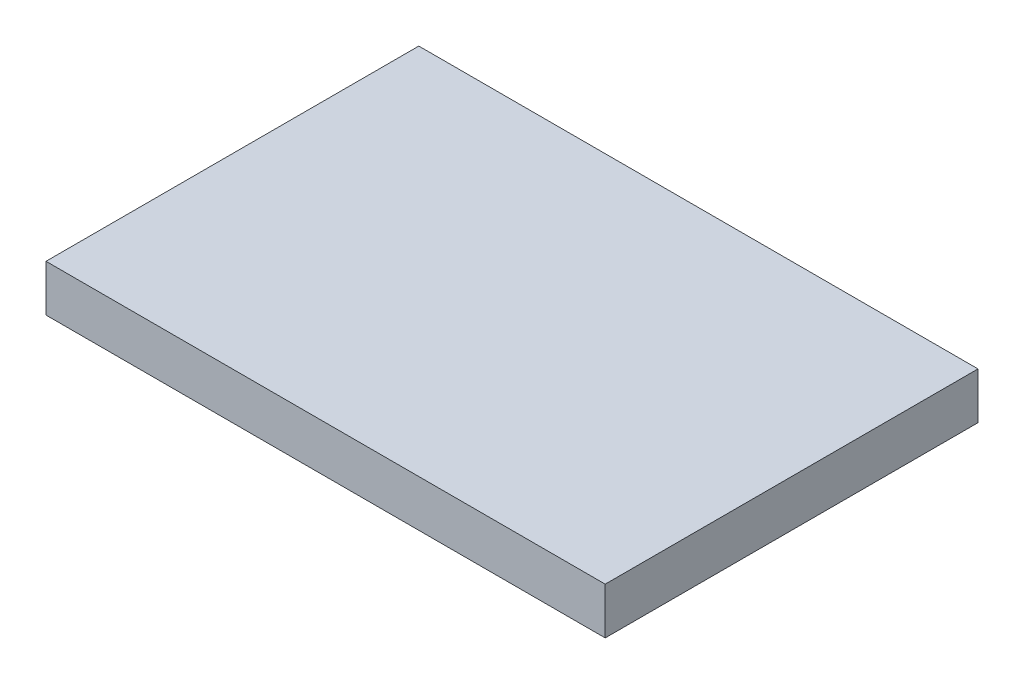
ISO-10303-21;
HEADER;
FILE_DESCRIPTION(('STEP AP214'),'2;1');
FILE_NAME('part.step','',(''),(''),'','','');
FILE_SCHEMA(('AUTOMOTIVE_DESIGN { 1 0 10303 214 1 1 1 1 }'));
ENDSEC;
DATA;
#1=APPLICATION_CONTEXT('core data for automotive mechanical design processes');
#2=APPLICATION_PROTOCOL_DEFINITION('international standard','automotive_design',2000,#1);
#3=PRODUCT_CONTEXT('',#1,'mechanical');
#4=PRODUCT('Part','Part','',(#3));
#5=PRODUCT_RELATED_PRODUCT_CATEGORY('part','',(#4));
#6=PRODUCT_DEFINITION_FORMATION('','',#4);
#7=PRODUCT_DEFINITION_CONTEXT('part definition',#1,'design');
#8=PRODUCT_DEFINITION('design','',#6,#7);
#9=PRODUCT_DEFINITION_SHAPE('','',#8);
#10=(LENGTH_UNIT() NAMED_UNIT(*) SI_UNIT(.MILLI.,.METRE.));
#11=(NAMED_UNIT(*) PLANE_ANGLE_UNIT() SI_UNIT($,.RADIAN.));
#12=(NAMED_UNIT(*) SI_UNIT($,.STERADIAN.) SOLID_ANGLE_UNIT());
#13=UNCERTAINTY_MEASURE_WITH_UNIT(LENGTH_MEASURE(1.E-05),#10,'distance_accuracy_value','');
#14=(GEOMETRIC_REPRESENTATION_CONTEXT(3) GLOBAL_UNCERTAINTY_ASSIGNED_CONTEXT((#13)) GLOBAL_UNIT_ASSIGNED_CONTEXT((#10,
#11,#12)) REPRESENTATION_CONTEXT('',''));
#15=CARTESIAN_POINT('',(0.,0.,0.));
#16=DIRECTION('',(0.,0.,1.));
#17=DIRECTION('',(1.,0.,0.));
#18=AXIS2_PLACEMENT_3D('',#15,#16,#17);
#19=CARTESIAN_POINT('',(-86.4894600922342,330.000000000016,26.9212642700331));
#20=DIRECTION('',(1.,0.,0.));
#21=DIRECTION('',(0.,0.,-1.));
#22=AXIS2_PLACEMENT_3D('',#19,#20,#21);
#23=PLANE('',#22);
#24=DIRECTION('',(0.,0.,-1.));
#25=VECTOR('',#24,1.);
#26=CARTESIAN_POINT('',(-86.4894600922342,340.000000000016,26.9212642700331));
#27=LINE('',#26,#25);
#28=CARTESIAN_POINT('',(-86.4894600922342,340.000000000016,26.9212642700331));
#29=VERTEX_POINT('',#28);
#30=CARTESIAN_POINT('',(-86.4894600922342,340.000000000016,-53.0787357299669));
#31=VERTEX_POINT('',#30);
#32=EDGE_CURVE('E96',#29,#31,#27,.T.);
#33=ORIENTED_EDGE('',*,*,#32,.T.);
#34=DIRECTION('',(0.,1.,0.));
#35=VECTOR('',#34,1.);
#36=CARTESIAN_POINT('',(-86.4894600922342,330.000000000016,-53.0787357299669));
#37=LINE('',#36,#35);
#38=CARTESIAN_POINT('',(-86.4894600922342,330.000000000016,-53.0787357299669));
#39=VERTEX_POINT('',#38);
#40=EDGE_CURVE('E11',#39,#31,#37,.T.);
#41=ORIENTED_EDGE('',*,*,#40,.F.);
#42=DIRECTION('',(0.,0.,-1.));
#43=VECTOR('',#42,1.);
#44=CARTESIAN_POINT('',(-86.4894600922342,330.000000000016,26.9212642700331));
#45=LINE('',#44,#43);
#46=CARTESIAN_POINT('',(-86.4894600922342,330.000000000016,26.9212642700331));
#47=VERTEX_POINT('',#46);
#48=EDGE_CURVE('E84',#47,#39,#45,.T.);
#49=ORIENTED_EDGE('',*,*,#48,.F.);
#50=DIRECTION('',(0.,1.,0.));
#51=VECTOR('',#50,1.);
#52=CARTESIAN_POINT('',(-86.4894600922342,330.000000000016,26.9212642700331));
#53=LINE('',#52,#51);
#54=EDGE_CURVE('E92',#47,#29,#53,.T.);
#55=ORIENTED_EDGE('',*,*,#54,.T.);
#56=EDGE_LOOP('',(#33,#41,#49,#55));
#57=FACE_BOUND('',#56,.T.);
#58=ADVANCED_FACE('F33',(#57),#23,.F.);
#59=CARTESIAN_POINT('',(-86.4894600922342,330.000000000016,-53.0787357299669));
#60=DIRECTION('',(0.,0.,1.));
#61=DIRECTION('',(1.,0.,0.));
#62=AXIS2_PLACEMENT_3D('',#59,#60,#61);
#63=PLANE('',#62);
#64=DIRECTION('',(1.,0.,0.));
#65=VECTOR('',#64,1.);
#66=CARTESIAN_POINT('',(-86.4894600922342,340.000000000016,-53.0787357299669));
#67=LINE('',#66,#65);
#68=CARTESIAN_POINT('',(33.5105399077658,340.000000000016,-53.0787357299669));
#69=VERTEX_POINT('',#68);
#70=EDGE_CURVE('E88',#31,#69,#67,.T.);
#71=ORIENTED_EDGE('',*,*,#70,.T.);
#72=DIRECTION('',(0.,1.,0.));
#73=VECTOR('',#72,1.);
#74=CARTESIAN_POINT('',(33.5105399077658,330.000000000016,-53.0787357299669));
#75=LINE('',#74,#73);
#76=CARTESIAN_POINT('',(33.5105399077658,330.000000000016,-53.0787357299669));
#77=VERTEX_POINT('',#76);
#78=EDGE_CURVE('E41',#77,#69,#75,.T.);
#79=ORIENTED_EDGE('',*,*,#78,.F.);
#80=DIRECTION('',(1.,0.,0.));
#81=VECTOR('',#80,1.);
#82=CARTESIAN_POINT('',(-86.4894600922342,330.000000000016,-53.0787357299669));
#83=LINE('',#82,#81);
#84=EDGE_CURVE('E79',#39,#77,#83,.T.);
#85=ORIENTED_EDGE('',*,*,#84,.F.);
#86=ORIENTED_EDGE('',*,*,#40,.T.);
#87=EDGE_LOOP('',(#71,#79,#85,#86));
#88=FACE_BOUND('',#87,.T.);
#89=ADVANCED_FACE('F87',(#88),#63,.F.);
#90=CARTESIAN_POINT('',(33.5105399077658,330.000000000016,26.9212642700331));
#91=DIRECTION('',(-1.,0.,0.));
#92=DIRECTION('',(0.,0.,1.));
#93=AXIS2_PLACEMENT_3D('',#90,#91,#92);
#94=PLANE('',#93);
#95=DIRECTION('',(0.,0.,1.));
#96=VECTOR('',#95,1.);
#97=CARTESIAN_POINT('',(33.5105399077658,340.000000000016,26.9212642700331));
#98=LINE('',#97,#96);
#99=CARTESIAN_POINT('',(33.5105399077658,340.000000000016,26.9212642700331));
#100=VERTEX_POINT('',#99);
#101=EDGE_CURVE('E66',#69,#100,#98,.T.);
#102=ORIENTED_EDGE('',*,*,#101,.T.);
#103=DIRECTION('',(0.,1.,0.));
#104=VECTOR('',#103,1.);
#105=CARTESIAN_POINT('',(33.5105399077658,330.000000000016,26.9212642700331));
#106=LINE('',#105,#104);
#107=CARTESIAN_POINT('',(33.5105399077658,330.000000000016,26.9212642700331));
#108=VERTEX_POINT('',#107);
#109=EDGE_CURVE('E89',#108,#100,#106,.T.);
#110=ORIENTED_EDGE('',*,*,#109,.F.);
#111=DIRECTION('',(0.,0.,1.));
#112=VECTOR('',#111,1.);
#113=CARTESIAN_POINT('',(33.5105399077658,330.000000000016,26.9212642700331));
#114=LINE('',#113,#112);
#115=EDGE_CURVE('E82',#77,#108,#114,.T.);
#116=ORIENTED_EDGE('',*,*,#115,.F.);
#117=ORIENTED_EDGE('',*,*,#78,.T.);
#118=EDGE_LOOP('',(#102,#110,#116,#117));
#119=FACE_BOUND('',#118,.T.);
#120=ADVANCED_FACE('F90',(#119),#94,.F.);
#121=CARTESIAN_POINT('',(-86.4894600922342,330.000000000016,26.9212642700331));
#122=DIRECTION('',(0.,0.,-1.));
#123=DIRECTION('',(-1.,0.,0.));
#124=AXIS2_PLACEMENT_3D('',#121,#122,#123);
#125=PLANE('',#124);
#126=DIRECTION('',(-1.,0.,0.));
#127=VECTOR('',#126,1.);
#128=CARTESIAN_POINT('',(-86.4894600922342,340.000000000016,26.9212642700331));
#129=LINE('',#128,#127);
#130=EDGE_CURVE('E72',#100,#29,#129,.T.);
#131=ORIENTED_EDGE('',*,*,#130,.T.);
#132=ORIENTED_EDGE('',*,*,#54,.F.);
#133=DIRECTION('',(-1.,0.,0.));
#134=VECTOR('',#133,1.);
#135=CARTESIAN_POINT('',(-86.4894600922342,330.000000000016,26.9212642700331));
#136=LINE('',#135,#134);
#137=EDGE_CURVE('E49',#108,#47,#136,.T.);
#138=ORIENTED_EDGE('',*,*,#137,.F.);
#139=ORIENTED_EDGE('',*,*,#109,.T.);
#140=EDGE_LOOP('',(#131,#132,#138,#139));
#141=FACE_BOUND('',#140,.T.);
#142=ADVANCED_FACE('F103',(#141),#125,.F.);
#143=CARTESIAN_POINT('',(-86.4894600922342,330.000000000016,-53.0787357299669));
#144=DIRECTION('',(0.,-1.,0.));
#145=DIRECTION('',(0.,0.,-1.));
#146=AXIS2_PLACEMENT_3D('',#143,#144,#145);
#147=PLANE('',#146);
#148=ORIENTED_EDGE('',*,*,#48,.T.);
#149=ORIENTED_EDGE('',*,*,#84,.T.);
#150=ORIENTED_EDGE('',*,*,#115,.T.);
#151=ORIENTED_EDGE('',*,*,#137,.T.);
#152=EDGE_LOOP('',(#148,#149,#150,#151));
#153=FACE_BOUND('',#152,.T.);
#154=ADVANCED_FACE('F80',(#153),#147,.T.);
#155=CARTESIAN_POINT('',(-86.4894600922342,340.000000000016,-53.0787357299669));
#156=DIRECTION('',(0.,-1.,0.));
#157=DIRECTION('',(0.,0.,-1.));
#158=AXIS2_PLACEMENT_3D('',#155,#156,#157);
#159=PLANE('',#158);
#160=ORIENTED_EDGE('',*,*,#32,.F.);
#161=ORIENTED_EDGE('',*,*,#130,.F.);
#162=ORIENTED_EDGE('',*,*,#101,.F.);
#163=ORIENTED_EDGE('',*,*,#70,.F.);
#164=EDGE_LOOP('',(#160,#161,#162,#163));
#165=FACE_BOUND('',#164,.T.);
#166=ADVANCED_FACE('F106',(#165),#159,.F.);
#167=CLOSED_SHELL('',(#58,#89,#120,#142,#154,#166));
#168=MANIFOLD_SOLID_BREP('B2',#167);
#169=ADVANCED_BREP_SHAPE_REPRESENTATION('',(#18,#168),#14);
#170=SHAPE_DEFINITION_REPRESENTATION(#9,#169);
ENDSEC;
END-ISO-10303-21;
